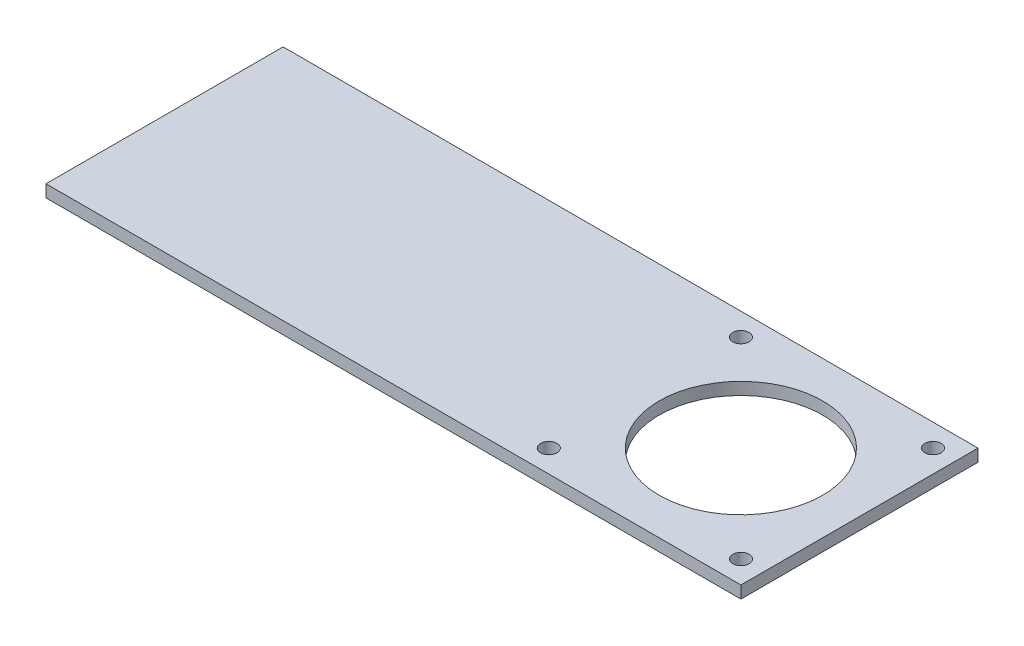
ISO-10303-21;
HEADER;
FILE_DESCRIPTION(('STEP AP214'),'2;1');
FILE_NAME('part.step','',(''),(''),'','','');
FILE_SCHEMA(('AUTOMOTIVE_DESIGN { 1 0 10303 214 1 1 1 1 }'));
ENDSEC;
DATA;
#1=APPLICATION_CONTEXT('core data for automotive mechanical design processes');
#2=APPLICATION_PROTOCOL_DEFINITION('international standard','automotive_design',2000,#1);
#3=PRODUCT_CONTEXT('',#1,'mechanical');
#4=PRODUCT('Part','Part','',(#3));
#5=PRODUCT_RELATED_PRODUCT_CATEGORY('part','',(#4));
#6=PRODUCT_DEFINITION_FORMATION('','',#4);
#7=PRODUCT_DEFINITION_CONTEXT('part definition',#1,'design');
#8=PRODUCT_DEFINITION('design','',#6,#7);
#9=PRODUCT_DEFINITION_SHAPE('','',#8);
#10=(LENGTH_UNIT() NAMED_UNIT(*) SI_UNIT(.MILLI.,.METRE.));
#11=(NAMED_UNIT(*) PLANE_ANGLE_UNIT() SI_UNIT($,.RADIAN.));
#12=(NAMED_UNIT(*) SI_UNIT($,.STERADIAN.) SOLID_ANGLE_UNIT());
#13=UNCERTAINTY_MEASURE_WITH_UNIT(LENGTH_MEASURE(1.E-05),#10,'distance_accuracy_value','');
#14=(GEOMETRIC_REPRESENTATION_CONTEXT(3) GLOBAL_UNCERTAINTY_ASSIGNED_CONTEXT((#13)) GLOBAL_UNIT_ASSIGNED_CONTEXT((#10,
#11,#12)) REPRESENTATION_CONTEXT('',''));
#15=CARTESIAN_POINT('',(0.,0.,0.));
#16=DIRECTION('',(0.,0.,1.));
#17=DIRECTION('',(1.,0.,0.));
#18=AXIS2_PLACEMENT_3D('',#15,#16,#17);
#19=CARTESIAN_POINT('',(-91.0636123638583,0.,58.));
#20=DIRECTION('',(1.,0.,0.));
#21=DIRECTION('',(0.,0.,-1.));
#22=AXIS2_PLACEMENT_3D('',#19,#20,#21);
#23=PLANE('',#22);
#24=DIRECTION('',(0.,-1.,0.));
#25=VECTOR('',#24,1.);
#26=CARTESIAN_POINT('',(-91.0636123638583,0.,0.));
#27=LINE('',#26,#25);
#28=CARTESIAN_POINT('',(-91.0636123638583,0.,0.));
#29=VERTEX_POINT('',#28);
#30=CARTESIAN_POINT('',(-91.0636123638583,-3.,0.));
#31=VERTEX_POINT('',#30);
#32=EDGE_CURVE('E99',#29,#31,#27,.T.);
#33=ORIENTED_EDGE('',*,*,#32,.T.);
#34=DIRECTION('',(0.,0.,-1.));
#35=VECTOR('',#34,1.);
#36=CARTESIAN_POINT('',(-91.0636123638583,-3.,58.));
#37=LINE('',#36,#35);
#38=CARTESIAN_POINT('',(-91.0636123638583,-3.,58.));
#39=VERTEX_POINT('',#38);
#40=EDGE_CURVE('E11',#39,#31,#37,.T.);
#41=ORIENTED_EDGE('',*,*,#40,.F.);
#42=DIRECTION('',(0.,-1.,0.));
#43=VECTOR('',#42,1.);
#44=CARTESIAN_POINT('',(-91.0636123638583,0.,58.));
#45=LINE('',#44,#43);
#46=CARTESIAN_POINT('',(-91.0636123638583,0.,58.));
#47=VERTEX_POINT('',#46);
#48=EDGE_CURVE('E87',#47,#39,#45,.T.);
#49=ORIENTED_EDGE('',*,*,#48,.F.);
#50=DIRECTION('',(0.,0.,-1.));
#51=VECTOR('',#50,1.);
#52=CARTESIAN_POINT('',(-91.0636123638583,0.,58.));
#53=LINE('',#52,#51);
#54=EDGE_CURVE('E95',#47,#29,#53,.T.);
#55=ORIENTED_EDGE('',*,*,#54,.T.);
#56=EDGE_LOOP('',(#33,#41,#49,#55));
#57=FACE_BOUND('',#56,.T.);
#58=ADVANCED_FACE('F36',(#57),#23,.F.);
#59=CARTESIAN_POINT('',(-91.0636123638583,-3.,58.));
#60=DIRECTION('',(0.,1.,0.));
#61=DIRECTION('',(0.,0.,1.));
#62=AXIS2_PLACEMENT_3D('',#59,#60,#61);
#63=PLANE('',#62);
#64=CARTESIAN_POINT('',(49.9363876361417,-3.,29.));
#65=DIRECTION('',(0.,1.,0.));
#66=DIRECTION('',(0.,0.,1.));
#67=AXIS2_PLACEMENT_3D('',#64,#65,#66);
#68=CIRCLE('',#67,20.);
#69=CARTESIAN_POINT('',(49.9363876361417,-3.,49.));
#70=VERTEX_POINT('',#69);
#71=EDGE_CURVE('E136',#70,#70,#68,.T.);
#72=ORIENTED_EDGE('',*,*,#71,.T.);
#73=EDGE_LOOP('',(#72));
#74=FACE_BOUND('',#73,.T.);
#75=CARTESIAN_POINT('',(26.4363876361417,-3.,5.50000000000003));
#76=DIRECTION('',(0.,1.,0.));
#77=DIRECTION('',(0.,0.,1.));
#78=AXIS2_PLACEMENT_3D('',#75,#76,#77);
#79=CIRCLE('',#78,2.00000000000001);
#80=CARTESIAN_POINT('',(26.4363876361417,-3.,7.50000000000004));
#81=VERTEX_POINT('',#80);
#82=EDGE_CURVE('E130',#81,#81,#79,.T.);
#83=ORIENTED_EDGE('',*,*,#82,.T.);
#84=EDGE_LOOP('',(#83));
#85=FACE_BOUND('',#84,.T.);
#86=CARTESIAN_POINT('',(26.4363876361417,-3.,52.5));
#87=DIRECTION('',(0.,1.,0.));
#88=DIRECTION('',(0.,0.,1.));
#89=AXIS2_PLACEMENT_3D('',#86,#87,#88);
#90=CIRCLE('',#89,2.00000000000001);
#91=CARTESIAN_POINT('',(26.4363876361417,-3.,54.5));
#92=VERTEX_POINT('',#91);
#93=EDGE_CURVE('E124',#92,#92,#90,.T.);
#94=ORIENTED_EDGE('',*,*,#93,.T.);
#95=EDGE_LOOP('',(#94));
#96=FACE_BOUND('',#95,.T.);
#97=CARTESIAN_POINT('',(73.4363876361417,-3.,52.5));
#98=DIRECTION('',(0.,1.,0.));
#99=DIRECTION('',(0.,0.,1.));
#100=AXIS2_PLACEMENT_3D('',#97,#98,#99);
#101=CIRCLE('',#100,2.00000000000001);
#102=CARTESIAN_POINT('',(73.4363876361417,-3.,54.5));
#103=VERTEX_POINT('',#102);
#104=EDGE_CURVE('E118',#103,#103,#101,.T.);
#105=ORIENTED_EDGE('',*,*,#104,.T.);
#106=EDGE_LOOP('',(#105));
#107=FACE_BOUND('',#106,.T.);
#108=CARTESIAN_POINT('',(73.4363876361417,-3.,5.5));
#109=DIRECTION('',(0.,1.,0.));
#110=DIRECTION('',(0.,0.,1.));
#111=AXIS2_PLACEMENT_3D('',#108,#109,#110);
#112=CIRCLE('',#111,2.00000000000001);
#113=CARTESIAN_POINT('',(73.4363876361417,-3.,7.50000000000001));
#114=VERTEX_POINT('',#113);
#115=EDGE_CURVE('E102',#114,#114,#112,.T.);
#116=ORIENTED_EDGE('',*,*,#115,.T.);
#117=EDGE_LOOP('',(#116));
#118=FACE_BOUND('',#117,.T.);
#119=DIRECTION('',(1.,0.,0.));
#120=VECTOR('',#119,1.);
#121=CARTESIAN_POINT('',(-91.0636123638583,-3.,0.));
#122=LINE('',#121,#120);
#123=CARTESIAN_POINT('',(78.9363876361417,-3.,0.));
#124=VERTEX_POINT('',#123);
#125=EDGE_CURVE('E91',#31,#124,#122,.T.);
#126=ORIENTED_EDGE('',*,*,#125,.T.);
#127=DIRECTION('',(0.,0.,-1.));
#128=VECTOR('',#127,1.);
#129=CARTESIAN_POINT('',(78.9363876361417,-3.,58.));
#130=LINE('',#129,#128);
#131=CARTESIAN_POINT('',(78.9363876361417,-3.,58.));
#132=VERTEX_POINT('',#131);
#133=EDGE_CURVE('E44',#132,#124,#130,.T.);
#134=ORIENTED_EDGE('',*,*,#133,.F.);
#135=DIRECTION('',(1.,0.,0.));
#136=VECTOR('',#135,1.);
#137=CARTESIAN_POINT('',(-91.0636123638583,-3.,58.));
#138=LINE('',#137,#136);
#139=EDGE_CURVE('E82',#39,#132,#138,.T.);
#140=ORIENTED_EDGE('',*,*,#139,.F.);
#141=ORIENTED_EDGE('',*,*,#40,.T.);
#142=EDGE_LOOP('',(#126,#134,#140,#141));
#143=FACE_BOUND('',#142,.T.);
#144=ADVANCED_FACE('F90',(#74,#85,#96,#107,#118,#143),#63,.F.);
#145=CARTESIAN_POINT('',(78.9363876361417,0.,58.));
#146=DIRECTION('',(-1.,0.,0.));
#147=DIRECTION('',(0.,0.,1.));
#148=AXIS2_PLACEMENT_3D('',#145,#146,#147);
#149=PLANE('',#148);
#150=DIRECTION('',(0.,1.,0.));
#151=VECTOR('',#150,1.);
#152=CARTESIAN_POINT('',(78.9363876361417,0.,0.));
#153=LINE('',#152,#151);
#154=CARTESIAN_POINT('',(78.9363876361417,0.,0.));
#155=VERTEX_POINT('',#154);
#156=EDGE_CURVE('E69',#124,#155,#153,.T.);
#157=ORIENTED_EDGE('',*,*,#156,.T.);
#158=DIRECTION('',(0.,0.,-1.));
#159=VECTOR('',#158,1.);
#160=CARTESIAN_POINT('',(78.9363876361417,0.,58.));
#161=LINE('',#160,#159);
#162=CARTESIAN_POINT('',(78.9363876361417,0.,58.));
#163=VERTEX_POINT('',#162);
#164=EDGE_CURVE('E92',#163,#155,#161,.T.);
#165=ORIENTED_EDGE('',*,*,#164,.F.);
#166=DIRECTION('',(0.,1.,0.));
#167=VECTOR('',#166,1.);
#168=CARTESIAN_POINT('',(78.9363876361417,0.,58.));
#169=LINE('',#168,#167);
#170=EDGE_CURVE('E85',#132,#163,#169,.T.);
#171=ORIENTED_EDGE('',*,*,#170,.F.);
#172=ORIENTED_EDGE('',*,*,#133,.T.);
#173=EDGE_LOOP('',(#157,#165,#171,#172));
#174=FACE_BOUND('',#173,.T.);
#175=ADVANCED_FACE('F93',(#174),#149,.F.);
#176=CARTESIAN_POINT('',(-91.0636123638583,0.,58.));
#177=DIRECTION('',(0.,-1.,0.));
#178=DIRECTION('',(0.,0.,-1.));
#179=AXIS2_PLACEMENT_3D('',#176,#177,#178);
#180=PLANE('',#179);
#181=CARTESIAN_POINT('',(49.9363876361417,0.,29.));
#182=DIRECTION('',(0.,1.,0.));
#183=DIRECTION('',(0.,0.,1.));
#184=AXIS2_PLACEMENT_3D('',#181,#182,#183);
#185=CIRCLE('',#184,20.);
#186=CARTESIAN_POINT('',(49.9363876361417,0.,49.));
#187=VERTEX_POINT('',#186);
#188=EDGE_CURVE('E139',#187,#187,#185,.T.);
#189=ORIENTED_EDGE('',*,*,#188,.F.);
#190=EDGE_LOOP('',(#189));
#191=FACE_BOUND('',#190,.T.);
#192=CARTESIAN_POINT('',(26.4363876361417,0.,5.50000000000003));
#193=DIRECTION('',(0.,1.,0.));
#194=DIRECTION('',(0.,0.,-1.));
#195=AXIS2_PLACEMENT_3D('',#192,#193,#194);
#196=CIRCLE('',#195,2.00000000000001);
#197=CARTESIAN_POINT('',(26.4363876361417,0.,3.50000000000002));
#198=VERTEX_POINT('',#197);
#199=EDGE_CURVE('E133',#198,#198,#196,.T.);
#200=ORIENTED_EDGE('',*,*,#199,.F.);
#201=EDGE_LOOP('',(#200));
#202=FACE_BOUND('',#201,.T.);
#203=CARTESIAN_POINT('',(26.4363876361417,0.,52.5));
#204=DIRECTION('',(0.,1.,0.));
#205=DIRECTION('',(0.,0.,1.));
#206=AXIS2_PLACEMENT_3D('',#203,#204,#205);
#207=CIRCLE('',#206,2.00000000000001);
#208=CARTESIAN_POINT('',(26.4363876361417,0.,54.5));
#209=VERTEX_POINT('',#208);
#210=EDGE_CURVE('E127',#209,#209,#207,.T.);
#211=ORIENTED_EDGE('',*,*,#210,.F.);
#212=EDGE_LOOP('',(#211));
#213=FACE_BOUND('',#212,.T.);
#214=CARTESIAN_POINT('',(73.4363876361417,0.,52.5));
#215=DIRECTION('',(0.,1.,0.));
#216=DIRECTION('',(0.,0.,-1.));
#217=AXIS2_PLACEMENT_3D('',#214,#215,#216);
#218=CIRCLE('',#217,2.00000000000001);
#219=CARTESIAN_POINT('',(73.4363876361417,0.,50.5));
#220=VERTEX_POINT('',#219);
#221=EDGE_CURVE('E121',#220,#220,#218,.T.);
#222=ORIENTED_EDGE('',*,*,#221,.F.);
#223=EDGE_LOOP('',(#222));
#224=FACE_BOUND('',#223,.T.);
#225=CARTESIAN_POINT('',(73.4363876361417,0.,5.5));
#226=DIRECTION('',(0.,1.,0.));
#227=DIRECTION('',(0.,0.,1.));
#228=AXIS2_PLACEMENT_3D('',#225,#226,#227);
#229=CIRCLE('',#228,2.00000000000001);
#230=CARTESIAN_POINT('',(73.4363876361417,0.,7.50000000000001));
#231=VERTEX_POINT('',#230);
#232=EDGE_CURVE('E115',#231,#231,#229,.T.);
#233=ORIENTED_EDGE('',*,*,#232,.F.);
#234=EDGE_LOOP('',(#233));
#235=FACE_BOUND('',#234,.T.);
#236=DIRECTION('',(-1.,0.,0.));
#237=VECTOR('',#236,1.);
#238=CARTESIAN_POINT('',(-91.0636123638583,0.,0.));
#239=LINE('',#238,#237);
#240=EDGE_CURVE('E75',#155,#29,#239,.T.);
#241=ORIENTED_EDGE('',*,*,#240,.T.);
#242=ORIENTED_EDGE('',*,*,#54,.F.);
#243=DIRECTION('',(-1.,0.,0.));
#244=VECTOR('',#243,1.);
#245=CARTESIAN_POINT('',(-91.0636123638583,0.,58.));
#246=LINE('',#245,#244);
#247=EDGE_CURVE('E52',#163,#47,#246,.T.);
#248=ORIENTED_EDGE('',*,*,#247,.F.);
#249=ORIENTED_EDGE('',*,*,#164,.T.);
#250=EDGE_LOOP('',(#241,#242,#248,#249));
#251=FACE_BOUND('',#250,.T.);
#252=ADVANCED_FACE('F107',(#191,#202,#213,#224,#235,#251),#180,.F.);
#253=CARTESIAN_POINT('',(0.,0.,58.));
#254=DIRECTION('',(0.,0.,1.));
#255=DIRECTION('',(1.,0.,0.));
#256=AXIS2_PLACEMENT_3D('',#253,#254,#255);
#257=PLANE('',#256);
#258=ORIENTED_EDGE('',*,*,#48,.T.);
#259=ORIENTED_EDGE('',*,*,#139,.T.);
#260=ORIENTED_EDGE('',*,*,#170,.T.);
#261=ORIENTED_EDGE('',*,*,#247,.T.);
#262=EDGE_LOOP('',(#258,#259,#260,#261));
#263=FACE_BOUND('',#262,.T.);
#264=ADVANCED_FACE('F83',(#263),#257,.T.);
#265=CARTESIAN_POINT('',(0.,0.,0.));
#266=DIRECTION('',(0.,0.,1.));
#267=DIRECTION('',(1.,0.,0.));
#268=AXIS2_PLACEMENT_3D('',#265,#266,#267);
#269=PLANE('',#268);
#270=ORIENTED_EDGE('',*,*,#32,.F.);
#271=ORIENTED_EDGE('',*,*,#240,.F.);
#272=ORIENTED_EDGE('',*,*,#156,.F.);
#273=ORIENTED_EDGE('',*,*,#125,.F.);
#274=EDGE_LOOP('',(#270,#271,#272,#273));
#275=FACE_BOUND('',#274,.T.);
#276=ADVANCED_FACE('F110',(#275),#269,.F.);
#277=CARTESIAN_POINT('',(73.4363876361417,-58.,5.5));
#278=DIRECTION('',(0.,1.,0.));
#279=DIRECTION('',(0.,0.,1.));
#280=AXIS2_PLACEMENT_3D('',#277,#278,#279);
#281=CYLINDRICAL_SURFACE('',#280,2.00000000000001);
#282=ORIENTED_EDGE('',*,*,#232,.T.);
#283=EDGE_LOOP('',(#282));
#284=FACE_BOUND('',#283,.T.);
#285=ORIENTED_EDGE('',*,*,#115,.F.);
#286=EDGE_LOOP('',(#285));
#287=FACE_BOUND('',#286,.T.);
#288=ADVANCED_FACE('F157',(#284,#287),#281,.F.);
#289=CARTESIAN_POINT('',(73.4363876361417,-58.,52.5));
#290=DIRECTION('',(0.,1.,0.));
#291=DIRECTION('',(0.,0.,1.));
#292=AXIS2_PLACEMENT_3D('',#289,#290,#291);
#293=CYLINDRICAL_SURFACE('',#292,2.00000000000001);
#294=ORIENTED_EDGE('',*,*,#221,.T.);
#295=EDGE_LOOP('',(#294));
#296=FACE_BOUND('',#295,.T.);
#297=ORIENTED_EDGE('',*,*,#104,.F.);
#298=EDGE_LOOP('',(#297));
#299=FACE_BOUND('',#298,.T.);
#300=ADVANCED_FACE('F160',(#296,#299),#293,.F.);
#301=CARTESIAN_POINT('',(26.4363876361417,-58.,52.5));
#302=DIRECTION('',(0.,1.,0.));
#303=DIRECTION('',(0.,0.,1.));
#304=AXIS2_PLACEMENT_3D('',#301,#302,#303);
#305=CYLINDRICAL_SURFACE('',#304,2.00000000000001);
#306=ORIENTED_EDGE('',*,*,#210,.T.);
#307=EDGE_LOOP('',(#306));
#308=FACE_BOUND('',#307,.T.);
#309=ORIENTED_EDGE('',*,*,#93,.F.);
#310=EDGE_LOOP('',(#309));
#311=FACE_BOUND('',#310,.T.);
#312=ADVANCED_FACE('F179',(#308,#311),#305,.F.);
#313=CARTESIAN_POINT('',(26.4363876361417,-58.,5.50000000000003));
#314=DIRECTION('',(0.,1.,0.));
#315=DIRECTION('',(0.,0.,1.));
#316=AXIS2_PLACEMENT_3D('',#313,#314,#315);
#317=CYLINDRICAL_SURFACE('',#316,2.00000000000001);
#318=ORIENTED_EDGE('',*,*,#199,.T.);
#319=EDGE_LOOP('',(#318));
#320=FACE_BOUND('',#319,.T.);
#321=ORIENTED_EDGE('',*,*,#82,.F.);
#322=EDGE_LOOP('',(#321));
#323=FACE_BOUND('',#322,.T.);
#324=ADVANCED_FACE('F183',(#320,#323),#317,.F.);
#325=CARTESIAN_POINT('',(49.9363876361417,-58.,29.));
#326=DIRECTION('',(0.,1.,0.));
#327=DIRECTION('',(0.,0.,1.));
#328=AXIS2_PLACEMENT_3D('',#325,#326,#327);
#329=CYLINDRICAL_SURFACE('',#328,20.);
#330=ORIENTED_EDGE('',*,*,#188,.T.);
#331=EDGE_LOOP('',(#330));
#332=FACE_BOUND('',#331,.T.);
#333=ORIENTED_EDGE('',*,*,#71,.F.);
#334=EDGE_LOOP('',(#333));
#335=FACE_BOUND('',#334,.T.);
#336=ADVANCED_FACE('F143',(#332,#335),#329,.F.);
#337=CLOSED_SHELL('',(#58,#144,#175,#252,#264,#276,#288,#300,#312,#324,#336));
#338=MANIFOLD_SOLID_BREP('B2',#337);
#339=ADVANCED_BREP_SHAPE_REPRESENTATION('',(#18,#338),#14);
#340=SHAPE_DEFINITION_REPRESENTATION(#9,#339);
ENDSEC;
END-ISO-10303-21;
